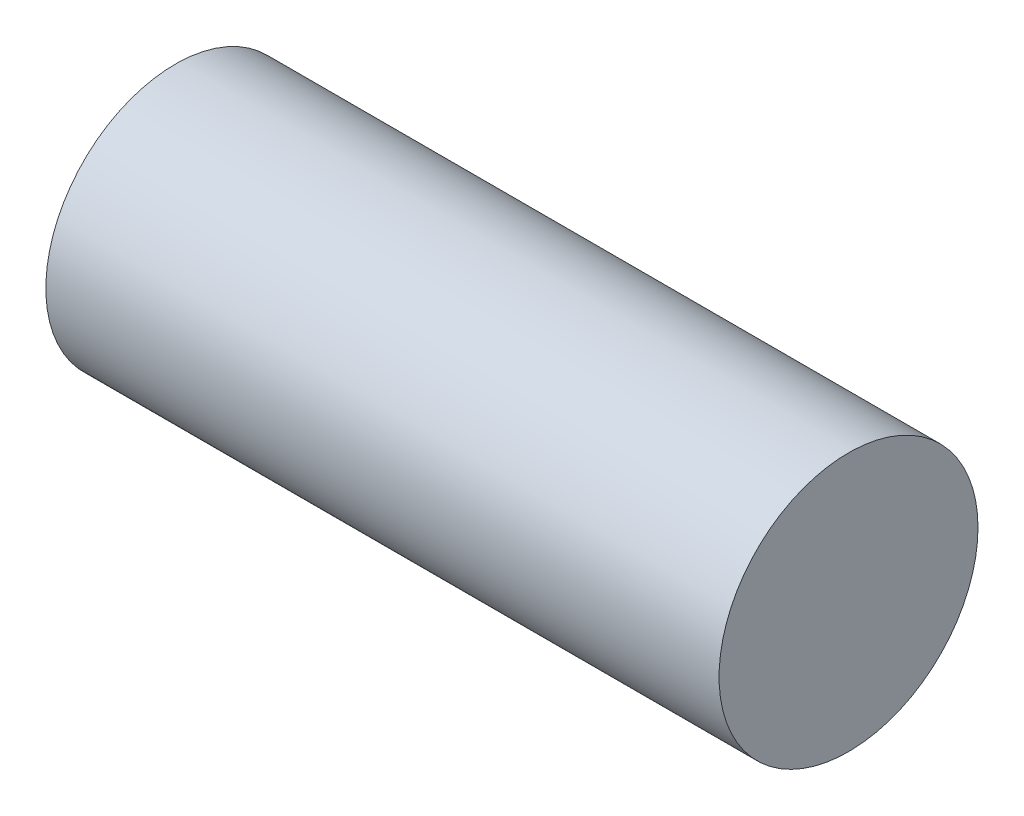
ISO-10303-21;
HEADER;
FILE_DESCRIPTION(('STEP AP214'),'2;1');
FILE_NAME('part.step','',(''),(''),'','','');
FILE_SCHEMA(('AUTOMOTIVE_DESIGN { 1 0 10303 214 1 1 1 1 }'));
ENDSEC;
DATA;
#1=APPLICATION_CONTEXT('core data for automotive mechanical design processes');
#2=APPLICATION_PROTOCOL_DEFINITION('international standard','automotive_design',2000,#1);
#3=PRODUCT_CONTEXT('',#1,'mechanical');
#4=PRODUCT('Part','Part','',(#3));
#5=PRODUCT_RELATED_PRODUCT_CATEGORY('part','',(#4));
#6=PRODUCT_DEFINITION_FORMATION('','',#4);
#7=PRODUCT_DEFINITION_CONTEXT('part definition',#1,'design');
#8=PRODUCT_DEFINITION('design','',#6,#7);
#9=PRODUCT_DEFINITION_SHAPE('','',#8);
#10=(LENGTH_UNIT() NAMED_UNIT(*) SI_UNIT(.MILLI.,.METRE.));
#11=(NAMED_UNIT(*) PLANE_ANGLE_UNIT() SI_UNIT($,.RADIAN.));
#12=(NAMED_UNIT(*) SI_UNIT($,.STERADIAN.) SOLID_ANGLE_UNIT());
#13=UNCERTAINTY_MEASURE_WITH_UNIT(LENGTH_MEASURE(1.E-05),#10,'distance_accuracy_value','');
#14=(GEOMETRIC_REPRESENTATION_CONTEXT(3) GLOBAL_UNCERTAINTY_ASSIGNED_CONTEXT((#13)) GLOBAL_UNIT_ASSIGNED_CONTEXT((#10,
#11,#12)) REPRESENTATION_CONTEXT('',''));
#15=CARTESIAN_POINT('',(0.,0.,0.));
#16=DIRECTION('',(0.,0.,1.));
#17=DIRECTION('',(1.,0.,0.));
#18=AXIS2_PLACEMENT_3D('',#15,#16,#17);
#19=CARTESIAN_POINT('',(26.,0.,0.));
#20=DIRECTION('',(-1.,0.,0.));
#21=DIRECTION('',(0.,0.,1.));
#22=AXIS2_PLACEMENT_3D('',#19,#20,#21);
#23=CYLINDRICAL_SURFACE('',#22,5.);
#24=CARTESIAN_POINT('',(26.,0.,0.));
#25=DIRECTION('',(1.,0.,0.));
#26=DIRECTION('',(0.,0.,-1.));
#27=AXIS2_PLACEMENT_3D('',#24,#25,#26);
#28=CIRCLE('',#27,5.);
#29=CARTESIAN_POINT('',(26.,0.,-5.));
#30=VERTEX_POINT('',#29);
#31=EDGE_CURVE('E10',#30,#30,#28,.T.);
#32=ORIENTED_EDGE('',*,*,#31,.F.);
#33=EDGE_LOOP('',(#32));
#34=FACE_BOUND('',#33,.T.);
#35=CARTESIAN_POINT('',(0.,0.,0.));
#36=DIRECTION('',(1.,0.,0.));
#37=DIRECTION('',(0.,0.,-1.));
#38=AXIS2_PLACEMENT_3D('',#35,#36,#37);
#39=CIRCLE('',#38,5.);
#40=CARTESIAN_POINT('',(0.,0.,-5.));
#41=VERTEX_POINT('',#40);
#42=EDGE_CURVE('E39',#41,#41,#39,.T.);
#43=ORIENTED_EDGE('',*,*,#42,.T.);
#44=EDGE_LOOP('',(#43));
#45=FACE_BOUND('',#44,.T.);
#46=ADVANCED_FACE('F33',(#34,#45),#23,.T.);
#47=CARTESIAN_POINT('',(26.,0.,0.));
#48=DIRECTION('',(1.,0.,0.));
#49=DIRECTION('',(0.,0.,-1.));
#50=AXIS2_PLACEMENT_3D('',#47,#48,#49);
#51=PLANE('',#50);
#52=ORIENTED_EDGE('',*,*,#31,.T.);
#53=EDGE_LOOP('',(#52));
#54=FACE_BOUND('',#53,.T.);
#55=ADVANCED_FACE('F48',(#54),#51,.T.);
#56=CARTESIAN_POINT('',(0.,0.,0.));
#57=DIRECTION('',(1.,0.,0.));
#58=DIRECTION('',(0.,0.,-1.));
#59=AXIS2_PLACEMENT_3D('',#56,#57,#58);
#60=PLANE('',#59);
#61=ORIENTED_EDGE('',*,*,#42,.F.);
#62=EDGE_LOOP('',(#61));
#63=FACE_BOUND('',#62,.T.);
#64=ADVANCED_FACE('F46',(#63),#60,.F.);
#65=CLOSED_SHELL('',(#46,#55,#64));
#66=MANIFOLD_SOLID_BREP('B2',#65);
#67=ADVANCED_BREP_SHAPE_REPRESENTATION('',(#18,#66),#14);
#68=SHAPE_DEFINITION_REPRESENTATION(#9,#67);
ENDSEC;
END-ISO-10303-21;
